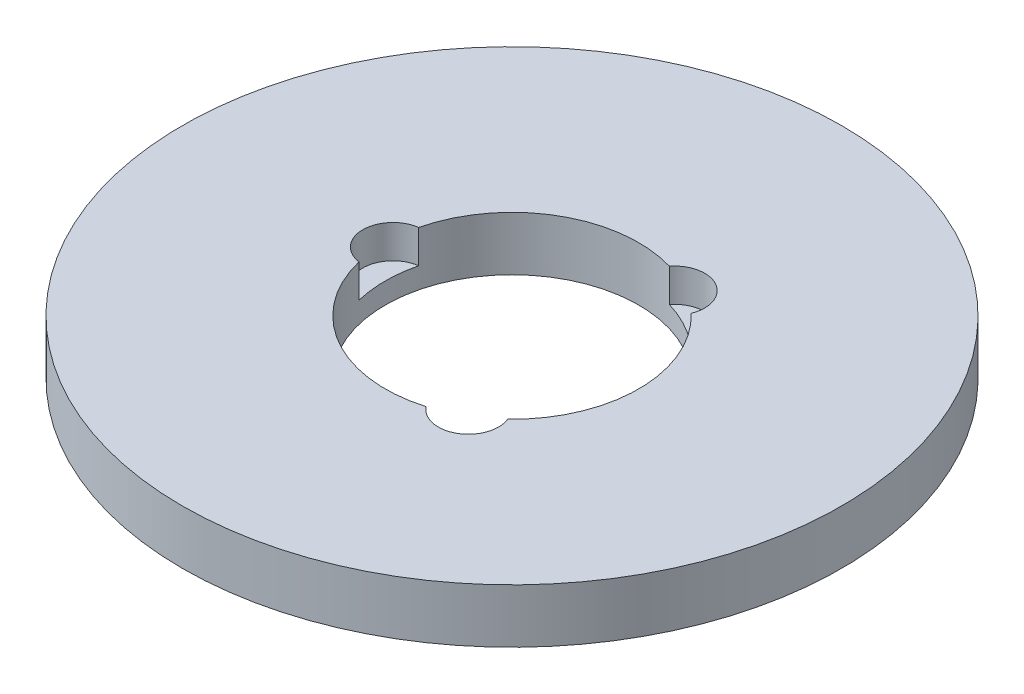
ISO-10303-21;
HEADER;
FILE_DESCRIPTION(('STEP AP214'),'2;1');
FILE_NAME('part.step','',(''),(''),'','','');
FILE_SCHEMA(('AUTOMOTIVE_DESIGN { 1 0 10303 214 1 1 1 1 }'));
ENDSEC;
DATA;
#1=APPLICATION_CONTEXT('core data for automotive mechanical design processes');
#2=APPLICATION_PROTOCOL_DEFINITION('international standard','automotive_design',2000,#1);
#3=PRODUCT_CONTEXT('',#1,'mechanical');
#4=PRODUCT('Part','Part','',(#3));
#5=PRODUCT_RELATED_PRODUCT_CATEGORY('part','',(#4));
#6=PRODUCT_DEFINITION_FORMATION('','',#4);
#7=PRODUCT_DEFINITION_CONTEXT('part definition',#1,'design');
#8=PRODUCT_DEFINITION('design','',#6,#7);
#9=PRODUCT_DEFINITION_SHAPE('','',#8);
#10=(LENGTH_UNIT() NAMED_UNIT(*) SI_UNIT(.MILLI.,.METRE.));
#11=(NAMED_UNIT(*) PLANE_ANGLE_UNIT() SI_UNIT($,.RADIAN.));
#12=(NAMED_UNIT(*) SI_UNIT($,.STERADIAN.) SOLID_ANGLE_UNIT());
#13=UNCERTAINTY_MEASURE_WITH_UNIT(LENGTH_MEASURE(1.E-05),#10,'distance_accuracy_value','');
#14=(GEOMETRIC_REPRESENTATION_CONTEXT(3) GLOBAL_UNCERTAINTY_ASSIGNED_CONTEXT((#13)) GLOBAL_UNIT_ASSIGNED_CONTEXT((#10,
#11,#12)) REPRESENTATION_CONTEXT('',''));
#15=CARTESIAN_POINT('',(0.,0.,0.));
#16=DIRECTION('',(0.,0.,1.));
#17=DIRECTION('',(1.,0.,0.));
#18=AXIS2_PLACEMENT_3D('',#15,#16,#17);
#19=CARTESIAN_POINT('',(0.,16.,0.));
#20=DIRECTION('',(0.,-1.,0.));
#21=DIRECTION('',(0.,0.,-1.));
#22=AXIS2_PLACEMENT_3D('',#19,#20,#21);
#23=CYLINDRICAL_SURFACE('',#22,97.5);
#24=CARTESIAN_POINT('',(0.,16.,0.));
#25=DIRECTION('',(0.,1.,0.));
#26=DIRECTION('',(0.,0.,1.));
#27=AXIS2_PLACEMENT_3D('',#24,#25,#26);
#28=CIRCLE('',#27,97.5);
#29=CARTESIAN_POINT('',(0.,16.,97.5));
#30=VERTEX_POINT('',#29);
#31=EDGE_CURVE('E130',#30,#30,#28,.T.);
#32=ORIENTED_EDGE('',*,*,#31,.F.);
#33=EDGE_LOOP('',(#32));
#34=FACE_BOUND('',#33,.T.);
#35=CARTESIAN_POINT('',(0.,0.,0.));
#36=DIRECTION('',(0.,1.,0.));
#37=DIRECTION('',(0.,0.,1.));
#38=AXIS2_PLACEMENT_3D('',#35,#36,#37);
#39=CIRCLE('',#38,97.5);
#40=CARTESIAN_POINT('',(0.,0.,97.5));
#41=VERTEX_POINT('',#40);
#42=EDGE_CURVE('E117',#41,#41,#39,.T.);
#43=ORIENTED_EDGE('',*,*,#42,.T.);
#44=EDGE_LOOP('',(#43));
#45=FACE_BOUND('',#44,.T.);
#46=ADVANCED_FACE('F39',(#34,#45),#23,.T.);
#47=CARTESIAN_POINT('',(0.,16.,0.));
#48=DIRECTION('',(0.,1.,0.));
#49=DIRECTION('',(0.,0.,1.));
#50=AXIS2_PLACEMENT_3D('',#47,#48,#49);
#51=PLANE('',#50);
#52=CARTESIAN_POINT('',(17.6086172807677,16.,30.4990197813247));
#53=DIRECTION('',(0.,1.,0.));
#54=DIRECTION('',(0.866025403784436,0.,-0.500000000000004));
#55=AXIS2_PLACEMENT_3D('',#52,#53,#54);
#56=CIRCLE('',#55,8.91161897773411);
#57=CARTESIAN_POINT('',(10.5793093658871,16.,35.9767732480396));
#58=VERTEX_POINT('',#57);
#59=CARTESIAN_POINT('',(25.8671448960514,16.,27.1503372893724));
#60=VERTEX_POINT('',#59);
#61=EDGE_CURVE('E148',#58,#60,#56,.T.);
#62=ORIENTED_EDGE('',*,*,#61,.F.);
#63=CARTESIAN_POINT('',(0.,16.,0.));
#64=DIRECTION('',(0.,1.,0.));
#65=DIRECTION('',(0.,0.,1.));
#66=AXIS2_PLACEMENT_3D('',#63,#64,#65);
#67=CIRCLE('',#66,37.5);
#68=CARTESIAN_POINT('',(-36.4464542619381,16.,8.82643595866712));
#69=VERTEX_POINT('',#68);
#70=EDGE_CURVE('E113',#69,#58,#67,.T.);
#71=ORIENTED_EDGE('',*,*,#70,.F.);
#72=CARTESIAN_POINT('',(-35.2172345615352,16.,0.));
#73=DIRECTION('',(0.,1.,0.));
#74=DIRECTION('',(0.,0.,1.));
#75=AXIS2_PLACEMENT_3D('',#72,#73,#74);
#76=CIRCLE('',#75,8.91161897773411);
#77=CARTESIAN_POINT('',(-36.4464542619381,16.,-8.82643595866712));
#78=VERTEX_POINT('',#77);
#79=EDGE_CURVE('E125',#78,#69,#76,.T.);
#80=ORIENTED_EDGE('',*,*,#79,.F.);
#81=CARTESIAN_POINT('',(10.5793093658866,16.,-35.9767732480397));
#82=VERTEX_POINT('',#81);
#83=EDGE_CURVE('E107',#82,#78,#67,.T.);
#84=ORIENTED_EDGE('',*,*,#83,.F.);
#85=CARTESIAN_POINT('',(17.6086172807673,16.,-30.4990197813249));
#86=DIRECTION('',(0.,1.,0.));
#87=DIRECTION('',(-0.866025403784443,0.,-0.499999999999992));
#88=AXIS2_PLACEMENT_3D('',#85,#86,#87);
#89=CIRCLE('',#88,8.91161897773411);
#90=CARTESIAN_POINT('',(25.867144896051,16.,-27.1503372893727));
#91=VERTEX_POINT('',#90);
#92=EDGE_CURVE('E95',#91,#82,#89,.T.);
#93=ORIENTED_EDGE('',*,*,#92,.F.);
#94=EDGE_CURVE('E106',#60,#91,#67,.T.);
#95=ORIENTED_EDGE('',*,*,#94,.F.);
#96=EDGE_LOOP('',(#62,#71,#80,#84,#93,#95));
#97=FACE_BOUND('',#96,.T.);
#98=ORIENTED_EDGE('',*,*,#31,.T.);
#99=EDGE_LOOP('',(#98));
#100=FACE_BOUND('',#99,.T.);
#101=ADVANCED_FACE('F102',(#97,#100),#51,.T.);
#102=CARTESIAN_POINT('',(0.,0.,0.));
#103=DIRECTION('',(0.,1.,0.));
#104=DIRECTION('',(0.,0.,1.));
#105=AXIS2_PLACEMENT_3D('',#102,#103,#104);
#106=PLANE('',#105);
#107=CARTESIAN_POINT('',(0.,0.,0.));
#108=DIRECTION('',(0.,1.,0.));
#109=DIRECTION('',(0.,0.,1.));
#110=AXIS2_PLACEMENT_3D('',#107,#108,#109);
#111=CIRCLE('',#110,37.5);
#112=CARTESIAN_POINT('',(0.,0.,37.5));
#113=VERTEX_POINT('',#112);
#114=EDGE_CURVE('E118',#113,#113,#111,.T.);
#115=ORIENTED_EDGE('',*,*,#114,.T.);
#116=EDGE_LOOP('',(#115));
#117=FACE_BOUND('',#116,.T.);
#118=ORIENTED_EDGE('',*,*,#42,.F.);
#119=EDGE_LOOP('',(#118));
#120=FACE_BOUND('',#119,.T.);
#121=ADVANCED_FACE('F161',(#117,#120),#106,.F.);
#122=CARTESIAN_POINT('',(0.,16.,0.));
#123=DIRECTION('',(0.,-1.,0.));
#124=DIRECTION('',(0.,0.,-1.));
#125=AXIS2_PLACEMENT_3D('',#122,#123,#124);
#126=CYLINDRICAL_SURFACE('',#125,37.5);
#127=DIRECTION('',(0.,1.,0.));
#128=VECTOR('',#127,1.);
#129=CARTESIAN_POINT('',(10.5793093658871,11.0931671237181,35.9767732480396));
#130=LINE('',#129,#128);
#131=CARTESIAN_POINT('',(10.5793093658871,6.18633424743614,35.9767732480396));
#132=VERTEX_POINT('',#131);
#133=EDGE_CURVE('E11',#132,#58,#130,.T.);
#134=ORIENTED_EDGE('',*,*,#133,.F.);
#135=CARTESIAN_POINT('',(0.,6.18633424743614,0.));
#136=DIRECTION('',(0.,1.,0.));
#137=DIRECTION('',(0.,0.,1.));
#138=AXIS2_PLACEMENT_3D('',#135,#136,#137);
#139=CIRCLE('',#138,37.5);
#140=CARTESIAN_POINT('',(25.8671448960514,6.18633424743614,27.1503372893724));
#141=VERTEX_POINT('',#140);
#142=EDGE_CURVE('E100',#132,#141,#139,.T.);
#143=ORIENTED_EDGE('',*,*,#142,.T.);
#144=DIRECTION('',(0.,1.,0.));
#145=VECTOR('',#144,1.);
#146=CARTESIAN_POINT('',(25.8671448960514,11.0931671237181,27.1503372893724));
#147=LINE('',#146,#145);
#148=EDGE_CURVE('E46',#60,#141,#147,.F.);
#149=ORIENTED_EDGE('',*,*,#148,.F.);
#150=ORIENTED_EDGE('',*,*,#94,.T.);
#151=DIRECTION('',(0.,1.,0.));
#152=VECTOR('',#151,1.);
#153=CARTESIAN_POINT('',(25.867144896051,11.0931671237181,-27.1503372893727));
#154=LINE('',#153,#152);
#155=CARTESIAN_POINT('',(25.867144896051,6.18633424743614,-27.1503372893727));
#156=VERTEX_POINT('',#155);
#157=EDGE_CURVE('E90',#156,#91,#154,.T.);
#158=ORIENTED_EDGE('',*,*,#157,.F.);
#159=CARTESIAN_POINT('',(0.,6.18633424743614,0.));
#160=DIRECTION('',(0.,1.,0.));
#161=DIRECTION('',(0.,0.,1.));
#162=AXIS2_PLACEMENT_3D('',#159,#160,#161);
#163=CIRCLE('',#162,37.5);
#164=CARTESIAN_POINT('',(10.5793093658866,6.18633424743614,-35.9767732480397));
#165=VERTEX_POINT('',#164);
#166=EDGE_CURVE('E143',#156,#165,#163,.T.);
#167=ORIENTED_EDGE('',*,*,#166,.T.);
#168=DIRECTION('',(0.,1.,0.));
#169=VECTOR('',#168,1.);
#170=CARTESIAN_POINT('',(10.5793093658865,11.0931671237181,-35.9767732480397));
#171=LINE('',#170,#169);
#172=EDGE_CURVE('E98',#82,#165,#171,.F.);
#173=ORIENTED_EDGE('',*,*,#172,.F.);
#174=ORIENTED_EDGE('',*,*,#83,.T.);
#175=DIRECTION('',(0.,1.,0.));
#176=VECTOR('',#175,1.);
#177=CARTESIAN_POINT('',(-36.4464542619381,11.0931671237181,-8.82643595866712));
#178=LINE('',#177,#176);
#179=CARTESIAN_POINT('',(-36.4464542619381,6.18633424743614,-8.82643595866712));
#180=VERTEX_POINT('',#179);
#181=EDGE_CURVE('E137',#180,#78,#178,.T.);
#182=ORIENTED_EDGE('',*,*,#181,.F.);
#183=CARTESIAN_POINT('',(0.,6.18633424743614,0.));
#184=DIRECTION('',(0.,1.,0.));
#185=DIRECTION('',(0.,0.,1.));
#186=AXIS2_PLACEMENT_3D('',#183,#184,#185);
#187=CIRCLE('',#186,37.5);
#188=CARTESIAN_POINT('',(-36.4464542619381,6.18633424743614,8.82643595866712));
#189=VERTEX_POINT('',#188);
#190=EDGE_CURVE('E128',#180,#189,#187,.T.);
#191=ORIENTED_EDGE('',*,*,#190,.T.);
#192=DIRECTION('',(0.,1.,0.));
#193=VECTOR('',#192,1.);
#194=CARTESIAN_POINT('',(-36.4464542619381,11.0931671237181,8.82643595866712));
#195=LINE('',#194,#193);
#196=EDGE_CURVE('E134',#69,#189,#195,.F.);
#197=ORIENTED_EDGE('',*,*,#196,.F.);
#198=ORIENTED_EDGE('',*,*,#70,.T.);
#199=EDGE_LOOP('',(#134,#143,#149,#150,#158,#167,#173,#174,#182,#191,#197,#198));
#200=FACE_BOUND('',#199,.T.);
#201=ORIENTED_EDGE('',*,*,#114,.F.);
#202=EDGE_LOOP('',(#201));
#203=FACE_BOUND('',#202,.T.);
#204=ADVANCED_FACE('F115',(#200,#203),#126,.F.);
#205=CARTESIAN_POINT('',(-35.2172345615352,6.18633424743614,0.));
#206=DIRECTION('',(0.,1.,0.));
#207=DIRECTION('',(0.,0.,1.));
#208=AXIS2_PLACEMENT_3D('',#205,#206,#207);
#209=CYLINDRICAL_SURFACE('',#208,8.91161897773411);
#210=ORIENTED_EDGE('',*,*,#181,.T.);
#211=ORIENTED_EDGE('',*,*,#79,.T.);
#212=ORIENTED_EDGE('',*,*,#196,.T.);
#213=CARTESIAN_POINT('',(-35.2172345615352,6.18633424743614,0.));
#214=DIRECTION('',(0.,1.,0.));
#215=DIRECTION('',(0.,0.,1.));
#216=AXIS2_PLACEMENT_3D('',#213,#214,#215);
#217=CIRCLE('',#216,8.91161897773411);
#218=EDGE_CURVE('E127',#180,#189,#217,.T.);
#219=ORIENTED_EDGE('',*,*,#218,.F.);
#220=EDGE_LOOP('',(#210,#211,#212,#219));
#221=FACE_BOUND('',#220,.T.);
#222=ADVANCED_FACE('F175',(#221),#209,.F.);
#223=CARTESIAN_POINT('',(-35.2172345615352,6.18633424743614,0.));
#224=DIRECTION('',(0.,1.,0.));
#225=DIRECTION('',(0.,0.,1.));
#226=AXIS2_PLACEMENT_3D('',#223,#224,#225);
#227=PLANE('',#226);
#228=ORIENTED_EDGE('',*,*,#218,.T.);
#229=ORIENTED_EDGE('',*,*,#190,.F.);
#230=EDGE_LOOP('',(#228,#229));
#231=FACE_BOUND('',#230,.T.);
#232=ADVANCED_FACE('F176',(#231),#227,.T.);
#233=CARTESIAN_POINT('',(17.6086172807673,6.18633424743614,-30.4990197813249));
#234=DIRECTION('',(0.,1.,0.));
#235=DIRECTION('',(0.,0.,1.));
#236=AXIS2_PLACEMENT_3D('',#233,#234,#235);
#237=CYLINDRICAL_SURFACE('',#236,8.91161897773411);
#238=ORIENTED_EDGE('',*,*,#157,.T.);
#239=ORIENTED_EDGE('',*,*,#92,.T.);
#240=ORIENTED_EDGE('',*,*,#172,.T.);
#241=CARTESIAN_POINT('',(17.6086172807673,6.18633424743614,-30.4990197813249));
#242=DIRECTION('',(0.,1.,0.));
#243=DIRECTION('',(-0.866025403784443,0.,-0.499999999999992));
#244=AXIS2_PLACEMENT_3D('',#241,#242,#243);
#245=CIRCLE('',#244,8.91161897773411);
#246=EDGE_CURVE('E56',#156,#165,#245,.T.);
#247=ORIENTED_EDGE('',*,*,#246,.F.);
#248=EDGE_LOOP('',(#238,#239,#240,#247));
#249=FACE_BOUND('',#248,.T.);
#250=ADVANCED_FACE('F93',(#249),#237,.F.);
#251=CARTESIAN_POINT('',(17.6086172807673,6.18633424743614,-30.4990197813249));
#252=DIRECTION('',(0.,1.,0.));
#253=DIRECTION('',(-0.866025403784443,0.,-0.499999999999992));
#254=AXIS2_PLACEMENT_3D('',#251,#252,#253);
#255=PLANE('',#254);
#256=ORIENTED_EDGE('',*,*,#246,.T.);
#257=ORIENTED_EDGE('',*,*,#166,.F.);
#258=EDGE_LOOP('',(#256,#257));
#259=FACE_BOUND('',#258,.T.);
#260=ADVANCED_FACE('F153',(#259),#255,.T.);
#261=CARTESIAN_POINT('',(17.6086172807677,6.18633424743614,30.4990197813247));
#262=DIRECTION('',(0.,1.,0.));
#263=DIRECTION('',(0.,0.,1.));
#264=AXIS2_PLACEMENT_3D('',#261,#262,#263);
#265=CYLINDRICAL_SURFACE('',#264,8.91161897773411);
#266=ORIENTED_EDGE('',*,*,#133,.T.);
#267=ORIENTED_EDGE('',*,*,#61,.T.);
#268=ORIENTED_EDGE('',*,*,#148,.T.);
#269=CARTESIAN_POINT('',(17.6086172807677,6.18633424743614,30.4990197813247));
#270=DIRECTION('',(0.,1.,0.));
#271=DIRECTION('',(0.866025403784436,0.,-0.500000000000004));
#272=AXIS2_PLACEMENT_3D('',#269,#270,#271);
#273=CIRCLE('',#272,8.91161897773411);
#274=EDGE_CURVE('E55',#132,#141,#273,.T.);
#275=ORIENTED_EDGE('',*,*,#274,.F.);
#276=EDGE_LOOP('',(#266,#267,#268,#275));
#277=FACE_BOUND('',#276,.T.);
#278=ADVANCED_FACE('F144',(#277),#265,.F.);
#279=CARTESIAN_POINT('',(17.6086172807677,6.18633424743614,30.4990197813247));
#280=DIRECTION('',(0.,1.,0.));
#281=DIRECTION('',(0.866025403784436,0.,-0.500000000000004));
#282=AXIS2_PLACEMENT_3D('',#279,#280,#281);
#283=PLANE('',#282);
#284=ORIENTED_EDGE('',*,*,#274,.T.);
#285=ORIENTED_EDGE('',*,*,#142,.F.);
#286=EDGE_LOOP('',(#284,#285));
#287=FACE_BOUND('',#286,.T.);
#288=ADVANCED_FACE('F150',(#287),#283,.T.);
#289=CLOSED_SHELL('',(#46,#101,#121,#204,#222,#232,#250,#260,#278,#288));
#290=MANIFOLD_SOLID_BREP('B2',#289);
#291=ADVANCED_BREP_SHAPE_REPRESENTATION('',(#18,#290),#14);
#292=SHAPE_DEFINITION_REPRESENTATION(#9,#291);
ENDSEC;
END-ISO-10303-21;
